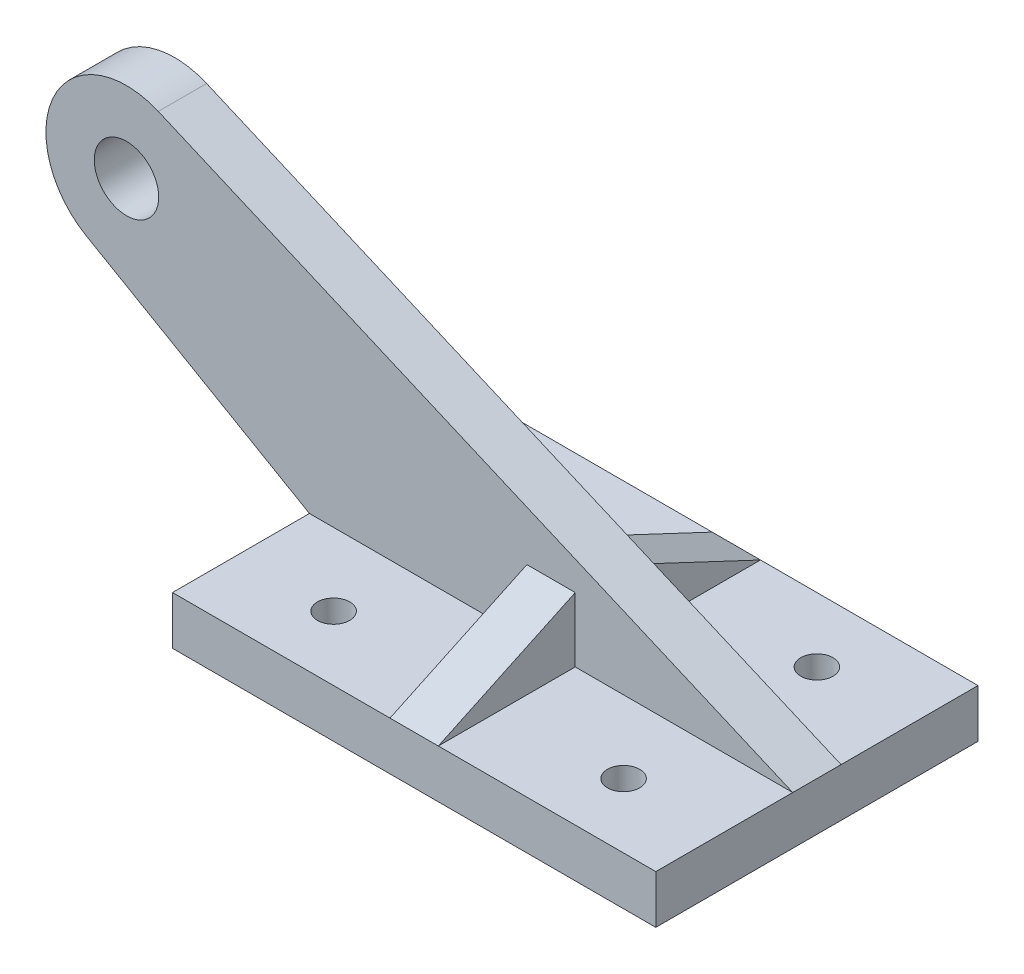
ISO-10303-21;
HEADER;
FILE_DESCRIPTION(('STEP AP214'),'2;1');
FILE_NAME('part.step','',(''),(''),'','','');
FILE_SCHEMA(('AUTOMOTIVE_DESIGN { 1 0 10303 214 1 1 1 1 }'));
ENDSEC;
DATA;
#1=APPLICATION_CONTEXT('core data for automotive mechanical design processes');
#2=APPLICATION_PROTOCOL_DEFINITION('international standard','automotive_design',2000,#1);
#3=PRODUCT_CONTEXT('',#1,'mechanical');
#4=PRODUCT('Part','Part','',(#3));
#5=PRODUCT_RELATED_PRODUCT_CATEGORY('part','',(#4));
#6=PRODUCT_DEFINITION_FORMATION('','',#4);
#7=PRODUCT_DEFINITION_CONTEXT('part definition',#1,'design');
#8=PRODUCT_DEFINITION('design','',#6,#7);
#9=PRODUCT_DEFINITION_SHAPE('','',#8);
#10=(LENGTH_UNIT() NAMED_UNIT(*) SI_UNIT(.MILLI.,.METRE.));
#11=(NAMED_UNIT(*) PLANE_ANGLE_UNIT() SI_UNIT($,.RADIAN.));
#12=(NAMED_UNIT(*) SI_UNIT($,.STERADIAN.) SOLID_ANGLE_UNIT());
#13=UNCERTAINTY_MEASURE_WITH_UNIT(LENGTH_MEASURE(1.E-05),#10,'distance_accuracy_value','');
#14=(GEOMETRIC_REPRESENTATION_CONTEXT(3) GLOBAL_UNCERTAINTY_ASSIGNED_CONTEXT((#13)) GLOBAL_UNIT_ASSIGNED_CONTEXT((#10,
#11,#12)) REPRESENTATION_CONTEXT('',''));
#15=CARTESIAN_POINT('',(0.,0.,0.));
#16=DIRECTION('',(0.,0.,1.));
#17=DIRECTION('',(1.,0.,0.));
#18=AXIS2_PLACEMENT_3D('',#15,#16,#17);
#19=CARTESIAN_POINT('',(0.,15.,0.));
#20=DIRECTION('',(0.,1.,0.));
#21=DIRECTION('',(0.,0.,1.));
#22=AXIS2_PLACEMENT_3D('',#19,#20,#21);
#23=PLANE('',#22);
#24=CARTESIAN_POINT('',(45.,15.,-30.));
#25=DIRECTION('',(0.,1.,0.));
#26=DIRECTION('',(0.,0.,1.));
#27=AXIS2_PLACEMENT_3D('',#24,#25,#26);
#28=CIRCLE('',#27,5.);
#29=CARTESIAN_POINT('',(45.,15.,-25.));
#30=VERTEX_POINT('',#29);
#31=EDGE_CURVE('E272',#30,#30,#28,.T.);
#32=ORIENTED_EDGE('',*,*,#31,.F.);
#33=EDGE_LOOP('',(#32));
#34=FACE_BOUND('',#33,.T.);
#35=DIRECTION('',(-1.,0.,0.));
#36=VECTOR('',#35,1.);
#37=CARTESIAN_POINT('',(-75.,15.,-50.));
#38=LINE('',#37,#36);
#39=CARTESIAN_POINT('',(75.,15.,-50.));
#40=VERTEX_POINT('',#39);
#41=CARTESIAN_POINT('',(7.5,15.,-50.));
#42=VERTEX_POINT('',#41);
#43=EDGE_CURVE('E158',#40,#42,#38,.T.);
#44=ORIENTED_EDGE('',*,*,#43,.T.);
#45=DIRECTION('',(0.,0.,-1.));
#46=VECTOR('',#45,1.);
#47=CARTESIAN_POINT('',(7.5,15.,-50.));
#48=LINE('',#47,#46);
#49=CARTESIAN_POINT('',(7.5,15.,-7.5));
#50=VERTEX_POINT('',#49);
#51=EDGE_CURVE('E145',#50,#42,#48,.T.);
#52=ORIENTED_EDGE('',*,*,#51,.F.);
#53=DIRECTION('',(1.,0.,0.));
#54=VECTOR('',#53,1.);
#55=CARTESIAN_POINT('',(75.,15.,-7.5));
#56=LINE('',#55,#54);
#57=CARTESIAN_POINT('',(75.,15.,-7.5));
#58=VERTEX_POINT('',#57);
#59=EDGE_CURVE('E543',#50,#58,#56,.T.);
#60=ORIENTED_EDGE('',*,*,#59,.T.);
#61=DIRECTION('',(0.,0.,-1.));
#62=VECTOR('',#61,1.);
#63=CARTESIAN_POINT('',(75.,15.,-50.));
#64=LINE('',#63,#62);
#65=EDGE_CURVE('E165',#58,#40,#64,.T.);
#66=ORIENTED_EDGE('',*,*,#65,.T.);
#67=EDGE_LOOP('',(#44,#52,#60,#66));
#68=FACE_BOUND('',#67,.T.);
#69=ADVANCED_FACE('F33',(#34,#68),#23,.T.);
#70=CARTESIAN_POINT('',(-131.782032302755,76.650635094611,-7.5));
#71=DIRECTION('',(0.,0.,1.));
#72=DIRECTION('',(1.,0.,0.));
#73=AXIS2_PLACEMENT_3D('',#70,#71,#72);
#74=PLANE('',#73);
#75=CARTESIAN_POINT('',(-131.782032302755,76.650635094611,-7.5));
#76=DIRECTION('',(0.,0.,1.));
#77=DIRECTION('',(1.,0.,0.));
#78=AXIS2_PLACEMENT_3D('',#75,#76,#77);
#79=CIRCLE('',#78,10.);
#80=CARTESIAN_POINT('',(-121.782032302755,76.650635094611,-7.5));
#81=VERTEX_POINT('',#80);
#82=EDGE_CURVE('E527',#81,#81,#79,.T.);
#83=ORIENTED_EDGE('',*,*,#82,.T.);
#84=EDGE_LOOP('',(#83));
#85=FACE_BOUND('',#84,.T.);
#86=DIRECTION('',(0.,-1.,0.));
#87=VECTOR('',#86,1.);
#88=CARTESIAN_POINT('',(7.5,15.,-7.5));
#89=LINE('',#88,#87);
#90=CARTESIAN_POINT('',(7.5,35.,-7.5));
#91=VERTEX_POINT('',#90);
#92=EDGE_CURVE('E144',#91,#50,#89,.T.);
#93=ORIENTED_EDGE('',*,*,#92,.F.);
#94=DIRECTION('',(-1.,0.,0.));
#95=VECTOR('',#94,1.);
#96=CARTESIAN_POINT('',(7.5,35.,-7.5));
#97=LINE('',#96,#95);
#98=CARTESIAN_POINT('',(-7.5,35.,-7.5));
#99=VERTEX_POINT('',#98);
#100=EDGE_CURVE('E141',#91,#99,#97,.T.);
#101=ORIENTED_EDGE('',*,*,#100,.T.);
#102=DIRECTION('',(0.,-1.,0.));
#103=VECTOR('',#102,1.);
#104=CARTESIAN_POINT('',(-7.5,15.,-7.5));
#105=LINE('',#104,#103);
#106=CARTESIAN_POINT('',(-7.50000000000001,15.,-7.5));
#107=VERTEX_POINT('',#106);
#108=EDGE_CURVE('E152',#99,#107,#105,.T.);
#109=ORIENTED_EDGE('',*,*,#108,.T.);
#110=CARTESIAN_POINT('',(-75.,15.,-7.5));
#111=VERTEX_POINT('',#110);
#112=EDGE_CURVE('E536',#111,#107,#56,.T.);
#113=ORIENTED_EDGE('',*,*,#112,.F.);
#114=DIRECTION('',(0.866025403784438,-0.500000000000001,0.));
#115=VECTOR('',#114,1.);
#116=CARTESIAN_POINT('',(-75.,15.,-7.5));
#117=LINE('',#116,#115);
#118=CARTESIAN_POINT('',(-144.282032302755,55.0000000000001,-7.5));
#119=VERTEX_POINT('',#118);
#120=EDGE_CURVE('E256',#119,#111,#117,.T.);
#121=ORIENTED_EDGE('',*,*,#120,.F.);
#122=CARTESIAN_POINT('',(-131.782032302755,76.650635094611,-7.5));
#123=DIRECTION('',(0.,0.,1.));
#124=DIRECTION('',(1.,0.,0.));
#125=AXIS2_PLACEMENT_3D('',#122,#123,#124);
#126=CIRCLE('',#125,25.);
#127=CARTESIAN_POINT('',(-121.911493446378,99.6195807100445,-7.5));
#128=VERTEX_POINT('',#127);
#129=EDGE_CURVE('E541',#128,#119,#126,.T.);
#130=ORIENTED_EDGE('',*,*,#129,.F.);
#131=DIRECTION('',(-0.91875782461734,0.394821554255101,0.));
#132=VECTOR('',#131,1.);
#133=CARTESIAN_POINT('',(75.,15.,-7.5));
#134=LINE('',#133,#132);
#135=EDGE_CURVE('E531',#58,#128,#134,.T.);
#136=ORIENTED_EDGE('',*,*,#135,.F.);
#137=ORIENTED_EDGE('',*,*,#59,.F.);
#138=EDGE_LOOP('',(#93,#101,#109,#113,#121,#130,#136,#137));
#139=FACE_BOUND('',#138,.T.);
#140=ADVANCED_FACE('F303',(#85,#139),#74,.F.);
#141=CARTESIAN_POINT('',(-45.,15.,30.));
#142=DIRECTION('',(0.,1.,0.));
#143=DIRECTION('',(0.,0.,1.));
#144=AXIS2_PLACEMENT_3D('',#141,#142,#143);
#145=CIRCLE('',#144,5.);
#146=CARTESIAN_POINT('',(-45.,15.,35.));
#147=VERTEX_POINT('',#146);
#148=EDGE_CURVE('E278',#147,#147,#145,.T.);
#149=ORIENTED_EDGE('',*,*,#148,.F.);
#150=EDGE_LOOP('',(#149));
#151=FACE_BOUND('',#150,.T.);
#152=DIRECTION('',(1.,0.,0.));
#153=VECTOR('',#152,1.);
#154=CARTESIAN_POINT('',(-75.,15.,50.));
#155=LINE('',#154,#153);
#156=CARTESIAN_POINT('',(-75.,15.,50.));
#157=VERTEX_POINT('',#156);
#158=CARTESIAN_POINT('',(-7.5,15.,50.));
#159=VERTEX_POINT('',#158);
#160=EDGE_CURVE('E176',#157,#159,#155,.T.);
#161=ORIENTED_EDGE('',*,*,#160,.T.);
#162=DIRECTION('',(0.,0.,-1.));
#163=VECTOR('',#162,1.);
#164=CARTESIAN_POINT('',(-7.5,15.,50.));
#165=LINE('',#164,#163);
#166=CARTESIAN_POINT('',(-7.5,15.,7.5));
#167=VERTEX_POINT('',#166);
#168=EDGE_CURVE('E162',#159,#167,#165,.T.);
#169=ORIENTED_EDGE('',*,*,#168,.T.);
#170=DIRECTION('',(1.,0.,0.));
#171=VECTOR('',#170,1.);
#172=CARTESIAN_POINT('',(75.,15.,7.5));
#173=LINE('',#172,#171);
#174=CARTESIAN_POINT('',(-75.,15.,7.5));
#175=VERTEX_POINT('',#174);
#176=EDGE_CURVE('E236',#175,#167,#173,.T.);
#177=ORIENTED_EDGE('',*,*,#176,.F.);
#178=DIRECTION('',(0.,0.,1.));
#179=VECTOR('',#178,1.);
#180=CARTESIAN_POINT('',(-75.,15.,-50.));
#181=LINE('',#180,#179);
#182=EDGE_CURVE('E166',#175,#157,#181,.T.);
#183=ORIENTED_EDGE('',*,*,#182,.T.);
#184=EDGE_LOOP('',(#161,#169,#177,#183));
#185=FACE_BOUND('',#184,.T.);
#186=ADVANCED_FACE('F233',(#151,#185),#23,.T.);
#187=DIRECTION('',(0.,0.,-1.));
#188=VECTOR('',#187,1.);
#189=CARTESIAN_POINT('',(-7.5,15.,-50.));
#190=LINE('',#189,#188);
#191=CARTESIAN_POINT('',(-7.5,15.,-50.));
#192=VERTEX_POINT('',#191);
#193=EDGE_CURVE('E48',#107,#192,#190,.T.);
#194=ORIENTED_EDGE('',*,*,#193,.T.);
#195=CARTESIAN_POINT('',(-75.,15.,-50.));
#196=VERTEX_POINT('',#195);
#197=EDGE_CURVE('E161',#192,#196,#38,.T.);
#198=ORIENTED_EDGE('',*,*,#197,.T.);
#199=EDGE_CURVE('E168',#196,#111,#181,.T.);
#200=ORIENTED_EDGE('',*,*,#199,.T.);
#201=ORIENTED_EDGE('',*,*,#112,.T.);
#202=EDGE_LOOP('',(#194,#198,#200,#201));
#203=FACE_BOUND('',#202,.T.);
#204=CARTESIAN_POINT('',(-45.,15.,-30.));
#205=DIRECTION('',(0.,1.,0.));
#206=DIRECTION('',(0.,0.,1.));
#207=AXIS2_PLACEMENT_3D('',#204,#205,#206);
#208=CIRCLE('',#207,5.);
#209=CARTESIAN_POINT('',(-45.,15.,-25.));
#210=VERTEX_POINT('',#209);
#211=EDGE_CURVE('E267',#210,#210,#208,.T.);
#212=ORIENTED_EDGE('',*,*,#211,.F.);
#213=EDGE_LOOP('',(#212));
#214=FACE_BOUND('',#213,.T.);
#215=ADVANCED_FACE('F293',(#203,#214),#23,.T.);
#216=CARTESIAN_POINT('',(75.,15.,-50.));
#217=DIRECTION('',(-1.,0.,0.));
#218=DIRECTION('',(0.,0.,1.));
#219=AXIS2_PLACEMENT_3D('',#216,#217,#218);
#220=PLANE('',#219);
#221=DIRECTION('',(0.,0.,-1.));
#222=VECTOR('',#221,1.);
#223=CARTESIAN_POINT('',(75.,0.,-50.));
#224=LINE('',#223,#222);
#225=CARTESIAN_POINT('',(75.,0.,50.));
#226=VERTEX_POINT('',#225);
#227=CARTESIAN_POINT('',(75.,0.,-50.));
#228=VERTEX_POINT('',#227);
#229=EDGE_CURVE('E180',#226,#228,#224,.T.);
#230=ORIENTED_EDGE('',*,*,#229,.T.);
#231=DIRECTION('',(0.,-1.,0.));
#232=VECTOR('',#231,1.);
#233=CARTESIAN_POINT('',(75.,15.,-50.));
#234=LINE('',#233,#232);
#235=EDGE_CURVE('E11',#40,#228,#234,.T.);
#236=ORIENTED_EDGE('',*,*,#235,.F.);
#237=ORIENTED_EDGE('',*,*,#65,.F.);
#238=DIRECTION('',(0.,0.,-1.));
#239=VECTOR('',#238,1.);
#240=CARTESIAN_POINT('',(75.,15.,7.5));
#241=LINE('',#240,#239);
#242=CARTESIAN_POINT('',(75.,15.,7.5));
#243=VERTEX_POINT('',#242);
#244=EDGE_CURVE('E214',#243,#58,#241,.T.);
#245=ORIENTED_EDGE('',*,*,#244,.F.);
#246=CARTESIAN_POINT('',(75.,15.,50.));
#247=VERTEX_POINT('',#246);
#248=EDGE_CURVE('E170',#247,#243,#64,.T.);
#249=ORIENTED_EDGE('',*,*,#248,.F.);
#250=DIRECTION('',(0.,-1.,0.));
#251=VECTOR('',#250,1.);
#252=CARTESIAN_POINT('',(75.,15.,50.));
#253=LINE('',#252,#251);
#254=EDGE_CURVE('E179',#247,#226,#253,.T.);
#255=ORIENTED_EDGE('',*,*,#254,.T.);
#256=EDGE_LOOP('',(#230,#236,#237,#245,#249,#255));
#257=FACE_BOUND('',#256,.T.);
#258=ADVANCED_FACE('F35',(#257),#220,.F.);
#259=CARTESIAN_POINT('',(-75.,15.,-50.));
#260=DIRECTION('',(0.,0.,1.));
#261=DIRECTION('',(1.,0.,0.));
#262=AXIS2_PLACEMENT_3D('',#259,#260,#261);
#263=PLANE('',#262);
#264=DIRECTION('',(-1.,0.,0.));
#265=VECTOR('',#264,1.);
#266=CARTESIAN_POINT('',(-75.,0.,-50.));
#267=LINE('',#266,#265);
#268=CARTESIAN_POINT('',(-75.,0.,-50.));
#269=VERTEX_POINT('',#268);
#270=EDGE_CURVE('E183',#228,#269,#267,.T.);
#271=ORIENTED_EDGE('',*,*,#270,.T.);
#272=DIRECTION('',(0.,-1.,0.));
#273=VECTOR('',#272,1.);
#274=CARTESIAN_POINT('',(-75.,15.,-50.));
#275=LINE('',#274,#273);
#276=EDGE_CURVE('E41',#196,#269,#275,.T.);
#277=ORIENTED_EDGE('',*,*,#276,.F.);
#278=ORIENTED_EDGE('',*,*,#197,.F.);
#279=DIRECTION('',(-1.,0.,0.));
#280=VECTOR('',#279,1.);
#281=CARTESIAN_POINT('',(7.5,15.,-50.));
#282=LINE('',#281,#280);
#283=EDGE_CURVE('E139',#42,#192,#282,.T.);
#284=ORIENTED_EDGE('',*,*,#283,.F.);
#285=ORIENTED_EDGE('',*,*,#43,.F.);
#286=ORIENTED_EDGE('',*,*,#235,.T.);
#287=EDGE_LOOP('',(#271,#277,#278,#284,#285,#286));
#288=FACE_BOUND('',#287,.T.);
#289=ADVANCED_FACE('F157',(#288),#263,.F.);
#290=CARTESIAN_POINT('',(-75.,15.,-50.));
#291=DIRECTION('',(1.,0.,0.));
#292=DIRECTION('',(0.,0.,-1.));
#293=AXIS2_PLACEMENT_3D('',#290,#291,#292);
#294=PLANE('',#293);
#295=DIRECTION('',(0.,0.,1.));
#296=VECTOR('',#295,1.);
#297=CARTESIAN_POINT('',(-75.,0.,-50.));
#298=LINE('',#297,#296);
#299=CARTESIAN_POINT('',(-75.,0.,50.));
#300=VERTEX_POINT('',#299);
#301=EDGE_CURVE('E186',#269,#300,#298,.T.);
#302=ORIENTED_EDGE('',*,*,#301,.T.);
#303=DIRECTION('',(0.,-1.,0.));
#304=VECTOR('',#303,1.);
#305=CARTESIAN_POINT('',(-75.,15.,50.));
#306=LINE('',#305,#304);
#307=EDGE_CURVE('E192',#157,#300,#306,.T.);
#308=ORIENTED_EDGE('',*,*,#307,.F.);
#309=ORIENTED_EDGE('',*,*,#182,.F.);
#310=DIRECTION('',(0.,0.,-1.));
#311=VECTOR('',#310,1.);
#312=CARTESIAN_POINT('',(-75.,15.,7.5));
#313=LINE('',#312,#311);
#314=EDGE_CURVE('E239',#175,#111,#313,.T.);
#315=ORIENTED_EDGE('',*,*,#314,.T.);
#316=ORIENTED_EDGE('',*,*,#199,.F.);
#317=ORIENTED_EDGE('',*,*,#276,.T.);
#318=EDGE_LOOP('',(#302,#308,#309,#315,#316,#317));
#319=FACE_BOUND('',#318,.T.);
#320=ADVANCED_FACE('F198',(#319),#294,.F.);
#321=CARTESIAN_POINT('',(-75.,15.,50.));
#322=DIRECTION('',(0.,0.,-1.));
#323=DIRECTION('',(-1.,0.,0.));
#324=AXIS2_PLACEMENT_3D('',#321,#322,#323);
#325=PLANE('',#324);
#326=DIRECTION('',(1.,0.,0.));
#327=VECTOR('',#326,1.);
#328=CARTESIAN_POINT('',(-75.,0.,50.));
#329=LINE('',#328,#327);
#330=EDGE_CURVE('E188',#300,#226,#329,.T.);
#331=ORIENTED_EDGE('',*,*,#330,.T.);
#332=ORIENTED_EDGE('',*,*,#254,.F.);
#333=CARTESIAN_POINT('',(7.5,15.,50.));
#334=VERTEX_POINT('',#333);
#335=EDGE_CURVE('E175',#334,#247,#155,.T.);
#336=ORIENTED_EDGE('',*,*,#335,.F.);
#337=DIRECTION('',(-1.,0.,0.));
#338=VECTOR('',#337,1.);
#339=CARTESIAN_POINT('',(7.5,15.,50.));
#340=LINE('',#339,#338);
#341=EDGE_CURVE('E225',#334,#159,#340,.T.);
#342=ORIENTED_EDGE('',*,*,#341,.T.);
#343=ORIENTED_EDGE('',*,*,#160,.F.);
#344=ORIENTED_EDGE('',*,*,#307,.T.);
#345=EDGE_LOOP('',(#331,#332,#336,#342,#343,#344));
#346=FACE_BOUND('',#345,.T.);
#347=ADVANCED_FACE('F206',(#346),#325,.F.);
#348=DIRECTION('',(0.,0.,-1.));
#349=VECTOR('',#348,1.);
#350=CARTESIAN_POINT('',(7.5,15.,50.));
#351=LINE('',#350,#349);
#352=CARTESIAN_POINT('',(7.5,15.,7.5));
#353=VERTEX_POINT('',#352);
#354=EDGE_CURVE('E222',#334,#353,#351,.T.);
#355=ORIENTED_EDGE('',*,*,#354,.F.);
#356=ORIENTED_EDGE('',*,*,#335,.T.);
#357=ORIENTED_EDGE('',*,*,#248,.T.);
#358=EDGE_CURVE('E221',#353,#243,#173,.T.);
#359=ORIENTED_EDGE('',*,*,#358,.F.);
#360=EDGE_LOOP('',(#355,#356,#357,#359));
#361=FACE_BOUND('',#360,.T.);
#362=CARTESIAN_POINT('',(45.,15.,30.));
#363=DIRECTION('',(0.,1.,0.));
#364=DIRECTION('',(0.,0.,1.));
#365=AXIS2_PLACEMENT_3D('',#362,#363,#364);
#366=CIRCLE('',#365,5.);
#367=CARTESIAN_POINT('',(45.,15.,35.));
#368=VERTEX_POINT('',#367);
#369=EDGE_CURVE('E271',#368,#368,#366,.T.);
#370=ORIENTED_EDGE('',*,*,#369,.F.);
#371=EDGE_LOOP('',(#370));
#372=FACE_BOUND('',#371,.T.);
#373=ADVANCED_FACE('F219',(#361,#372),#23,.T.);
#374=CARTESIAN_POINT('',(0.,0.,0.));
#375=DIRECTION('',(0.,1.,0.));
#376=DIRECTION('',(0.,0.,1.));
#377=AXIS2_PLACEMENT_3D('',#374,#375,#376);
#378=PLANE('',#377);
#379=CARTESIAN_POINT('',(45.,0.,-30.));
#380=DIRECTION('',(0.,1.,0.));
#381=DIRECTION('',(0.,0.,1.));
#382=AXIS2_PLACEMENT_3D('',#379,#380,#381);
#383=CIRCLE('',#382,5.);
#384=CARTESIAN_POINT('',(45.,0.,-25.));
#385=VERTEX_POINT('',#384);
#386=EDGE_CURVE('E268',#385,#385,#383,.T.);
#387=ORIENTED_EDGE('',*,*,#386,.T.);
#388=EDGE_LOOP('',(#387));
#389=FACE_BOUND('',#388,.T.);
#390=CARTESIAN_POINT('',(-45.,0.,30.));
#391=DIRECTION('',(0.,1.,0.));
#392=DIRECTION('',(0.,0.,1.));
#393=AXIS2_PLACEMENT_3D('',#390,#391,#392);
#394=CIRCLE('',#393,5.);
#395=CARTESIAN_POINT('',(-45.,0.,35.));
#396=VERTEX_POINT('',#395);
#397=EDGE_CURVE('E275',#396,#396,#394,.T.);
#398=ORIENTED_EDGE('',*,*,#397,.T.);
#399=EDGE_LOOP('',(#398));
#400=FACE_BOUND('',#399,.T.);
#401=CARTESIAN_POINT('',(-45.,0.,-30.));
#402=DIRECTION('',(0.,1.,0.));
#403=DIRECTION('',(0.,0.,1.));
#404=AXIS2_PLACEMENT_3D('',#401,#402,#403);
#405=CIRCLE('',#404,5.);
#406=CARTESIAN_POINT('',(-45.,0.,-25.));
#407=VERTEX_POINT('',#406);
#408=EDGE_CURVE('E281',#407,#407,#405,.T.);
#409=ORIENTED_EDGE('',*,*,#408,.T.);
#410=EDGE_LOOP('',(#409));
#411=FACE_BOUND('',#410,.T.);
#412=CARTESIAN_POINT('',(45.,0.,30.));
#413=DIRECTION('',(0.,1.,0.));
#414=DIRECTION('',(0.,0.,1.));
#415=AXIS2_PLACEMENT_3D('',#412,#413,#414);
#416=CIRCLE('',#415,5.);
#417=CARTESIAN_POINT('',(45.,0.,35.));
#418=VERTEX_POINT('',#417);
#419=EDGE_CURVE('E184',#418,#418,#416,.T.);
#420=ORIENTED_EDGE('',*,*,#419,.T.);
#421=EDGE_LOOP('',(#420));
#422=FACE_BOUND('',#421,.T.);
#423=ORIENTED_EDGE('',*,*,#229,.F.);
#424=ORIENTED_EDGE('',*,*,#330,.F.);
#425=ORIENTED_EDGE('',*,*,#301,.F.);
#426=ORIENTED_EDGE('',*,*,#270,.F.);
#427=EDGE_LOOP('',(#423,#424,#425,#426));
#428=FACE_BOUND('',#427,.T.);
#429=ADVANCED_FACE('F203',(#389,#400,#411,#422,#428),#378,.F.);
#430=CARTESIAN_POINT('',(45.,0.,30.));
#431=DIRECTION('',(0.,1.,0.));
#432=DIRECTION('',(0.,0.,1.));
#433=AXIS2_PLACEMENT_3D('',#430,#431,#432);
#434=CYLINDRICAL_SURFACE('',#433,5.);
#435=ORIENTED_EDGE('',*,*,#419,.F.);
#436=EDGE_LOOP('',(#435));
#437=FACE_BOUND('',#436,.T.);
#438=ORIENTED_EDGE('',*,*,#369,.T.);
#439=EDGE_LOOP('',(#438));
#440=FACE_BOUND('',#439,.T.);
#441=ADVANCED_FACE('F290',(#437,#440),#434,.F.);
#442=CARTESIAN_POINT('',(-45.,0.,-30.));
#443=DIRECTION('',(0.,1.,0.));
#444=DIRECTION('',(0.,0.,1.));
#445=AXIS2_PLACEMENT_3D('',#442,#443,#444);
#446=CYLINDRICAL_SURFACE('',#445,5.);
#447=ORIENTED_EDGE('',*,*,#408,.F.);
#448=EDGE_LOOP('',(#447));
#449=FACE_BOUND('',#448,.T.);
#450=ORIENTED_EDGE('',*,*,#211,.T.);
#451=EDGE_LOOP('',(#450));
#452=FACE_BOUND('',#451,.T.);
#453=ADVANCED_FACE('F316',(#449,#452),#446,.F.);
#454=CARTESIAN_POINT('',(-45.,0.,30.));
#455=DIRECTION('',(0.,1.,0.));
#456=DIRECTION('',(0.,0.,1.));
#457=AXIS2_PLACEMENT_3D('',#454,#455,#456);
#458=CYLINDRICAL_SURFACE('',#457,5.);
#459=ORIENTED_EDGE('',*,*,#397,.F.);
#460=EDGE_LOOP('',(#459));
#461=FACE_BOUND('',#460,.T.);
#462=ORIENTED_EDGE('',*,*,#148,.T.);
#463=EDGE_LOOP('',(#462));
#464=FACE_BOUND('',#463,.T.);
#465=ADVANCED_FACE('F318',(#461,#464),#458,.F.);
#466=CARTESIAN_POINT('',(45.,0.,-30.));
#467=DIRECTION('',(0.,1.,0.));
#468=DIRECTION('',(0.,0.,1.));
#469=AXIS2_PLACEMENT_3D('',#466,#467,#468);
#470=CYLINDRICAL_SURFACE('',#469,5.);
#471=ORIENTED_EDGE('',*,*,#386,.F.);
#472=EDGE_LOOP('',(#471));
#473=FACE_BOUND('',#472,.T.);
#474=ORIENTED_EDGE('',*,*,#31,.T.);
#475=EDGE_LOOP('',(#474));
#476=FACE_BOUND('',#475,.T.);
#477=ADVANCED_FACE('F325',(#473,#476),#470,.F.);
#478=CARTESIAN_POINT('',(-131.782032302755,76.650635094611,7.5));
#479=DIRECTION('',(0.,0.,1.));
#480=DIRECTION('',(1.,0.,0.));
#481=AXIS2_PLACEMENT_3D('',#478,#479,#480);
#482=PLANE('',#481);
#483=DIRECTION('',(0.,1.,0.));
#484=VECTOR('',#483,1.);
#485=CARTESIAN_POINT('',(7.5,15.,7.5));
#486=LINE('',#485,#484);
#487=CARTESIAN_POINT('',(7.5,35.,7.5));
#488=VERTEX_POINT('',#487);
#489=EDGE_CURVE('E516',#353,#488,#486,.T.);
#490=ORIENTED_EDGE('',*,*,#489,.F.);
#491=ORIENTED_EDGE('',*,*,#358,.T.);
#492=DIRECTION('',(-0.91875782461734,0.394821554255101,0.));
#493=VECTOR('',#492,1.);
#494=CARTESIAN_POINT('',(75.,15.,7.5));
#495=LINE('',#494,#493);
#496=CARTESIAN_POINT('',(-121.911493446378,99.6195807100445,7.5));
#497=VERTEX_POINT('',#496);
#498=EDGE_CURVE('E534',#243,#497,#495,.T.);
#499=ORIENTED_EDGE('',*,*,#498,.T.);
#500=CARTESIAN_POINT('',(-131.782032302755,76.650635094611,7.5));
#501=DIRECTION('',(0.,0.,1.));
#502=DIRECTION('',(1.,0.,0.));
#503=AXIS2_PLACEMENT_3D('',#500,#501,#502);
#504=CIRCLE('',#503,25.);
#505=CARTESIAN_POINT('',(-144.282032302755,55.0000000000001,7.5));
#506=VERTEX_POINT('',#505);
#507=EDGE_CURVE('E248',#497,#506,#504,.T.);
#508=ORIENTED_EDGE('',*,*,#507,.T.);
#509=DIRECTION('',(0.866025403784438,-0.500000000000001,0.));
#510=VECTOR('',#509,1.);
#511=CARTESIAN_POINT('',(-75.,15.,7.5));
#512=LINE('',#511,#510);
#513=EDGE_CURVE('E242',#506,#175,#512,.T.);
#514=ORIENTED_EDGE('',*,*,#513,.T.);
#515=ORIENTED_EDGE('',*,*,#176,.T.);
#516=DIRECTION('',(0.,1.,0.));
#517=VECTOR('',#516,1.);
#518=CARTESIAN_POINT('',(-7.5,15.,7.5));
#519=LINE('',#518,#517);
#520=CARTESIAN_POINT('',(-7.50000000000001,35.,7.5));
#521=VERTEX_POINT('',#520);
#522=EDGE_CURVE('E523',#167,#521,#519,.T.);
#523=ORIENTED_EDGE('',*,*,#522,.T.);
#524=DIRECTION('',(-1.,0.,0.));
#525=VECTOR('',#524,1.);
#526=CARTESIAN_POINT('',(7.5,35.,7.5));
#527=LINE('',#526,#525);
#528=EDGE_CURVE('E228',#488,#521,#527,.T.);
#529=ORIENTED_EDGE('',*,*,#528,.F.);
#530=EDGE_LOOP('',(#490,#491,#499,#508,#514,#515,#523,#529));
#531=FACE_BOUND('',#530,.T.);
#532=CARTESIAN_POINT('',(-131.782032302755,76.650635094611,7.5));
#533=DIRECTION('',(0.,0.,1.));
#534=DIRECTION('',(1.,0.,0.));
#535=AXIS2_PLACEMENT_3D('',#532,#533,#534);
#536=CIRCLE('',#535,10.);
#537=CARTESIAN_POINT('',(-121.782032302755,76.650635094611,7.5));
#538=VERTEX_POINT('',#537);
#539=EDGE_CURVE('E528',#538,#538,#536,.T.);
#540=ORIENTED_EDGE('',*,*,#539,.F.);
#541=EDGE_LOOP('',(#540));
#542=FACE_BOUND('',#541,.T.);
#543=ADVANCED_FACE('F244',(#531,#542),#482,.T.);
#544=CARTESIAN_POINT('',(75.,15.,7.5));
#545=DIRECTION('',(-0.394821554255101,-0.91875782461734,0.));
#546=DIRECTION('',(0.91875782461734,-0.394821554255101,0.));
#547=AXIS2_PLACEMENT_3D('',#544,#545,#546);
#548=PLANE('',#547);
#549=ORIENTED_EDGE('',*,*,#135,.T.);
#550=DIRECTION('',(0.,0.,-1.));
#551=VECTOR('',#550,1.);
#552=CARTESIAN_POINT('',(-121.911493446378,99.6195807100445,7.5));
#553=LINE('',#552,#551);
#554=EDGE_CURVE('E260',#497,#128,#553,.T.);
#555=ORIENTED_EDGE('',*,*,#554,.F.);
#556=ORIENTED_EDGE('',*,*,#498,.F.);
#557=ORIENTED_EDGE('',*,*,#244,.T.);
#558=EDGE_LOOP('',(#549,#555,#556,#557));
#559=FACE_BOUND('',#558,.T.);
#560=ADVANCED_FACE('F334',(#559),#548,.F.);
#561=CARTESIAN_POINT('',(-131.782032302755,76.650635094611,7.5));
#562=DIRECTION('',(0.,0.,-1.));
#563=DIRECTION('',(-1.,0.,0.));
#564=AXIS2_PLACEMENT_3D('',#561,#562,#563);
#565=CYLINDRICAL_SURFACE('',#564,25.);
#566=ORIENTED_EDGE('',*,*,#129,.T.);
#567=DIRECTION('',(0.,0.,-1.));
#568=VECTOR('',#567,1.);
#569=CARTESIAN_POINT('',(-144.282032302755,55.0000000000001,7.5));
#570=LINE('',#569,#568);
#571=EDGE_CURVE('E258',#506,#119,#570,.T.);
#572=ORIENTED_EDGE('',*,*,#571,.F.);
#573=ORIENTED_EDGE('',*,*,#507,.F.);
#574=ORIENTED_EDGE('',*,*,#554,.T.);
#575=EDGE_LOOP('',(#566,#572,#573,#574));
#576=FACE_BOUND('',#575,.T.);
#577=ADVANCED_FACE('F337',(#576),#565,.T.);
#578=CARTESIAN_POINT('',(-75.,15.,7.5));
#579=DIRECTION('',(0.500000000000001,0.866025403784438,0.));
#580=DIRECTION('',(-0.866025403784438,0.500000000000001,0.));
#581=AXIS2_PLACEMENT_3D('',#578,#579,#580);
#582=PLANE('',#581);
#583=ORIENTED_EDGE('',*,*,#120,.T.);
#584=ORIENTED_EDGE('',*,*,#314,.F.);
#585=ORIENTED_EDGE('',*,*,#513,.F.);
#586=ORIENTED_EDGE('',*,*,#571,.T.);
#587=EDGE_LOOP('',(#583,#584,#585,#586));
#588=FACE_BOUND('',#587,.T.);
#589=ADVANCED_FACE('F254',(#588),#582,.F.);
#590=CARTESIAN_POINT('',(-131.782032302755,76.650635094611,7.5));
#591=DIRECTION('',(0.,0.,-1.));
#592=DIRECTION('',(-1.,0.,0.));
#593=AXIS2_PLACEMENT_3D('',#590,#591,#592);
#594=CYLINDRICAL_SURFACE('',#593,10.);
#595=ORIENTED_EDGE('',*,*,#539,.T.);
#596=EDGE_LOOP('',(#595));
#597=FACE_BOUND('',#596,.T.);
#598=ORIENTED_EDGE('',*,*,#82,.F.);
#599=EDGE_LOOP('',(#598));
#600=FACE_BOUND('',#599,.T.);
#601=ADVANCED_FACE('F344',(#597,#600),#594,.F.);
#602=CARTESIAN_POINT('',(7.5,35.,7.5));
#603=DIRECTION('',(0.,-0.904818702200994,-0.42579703632988));
#604=DIRECTION('',(0.,0.42579703632988,-0.904818702200994));
#605=AXIS2_PLACEMENT_3D('',#602,#603,#604);
#606=PLANE('',#605);
#607=DIRECTION('',(0.,-0.42579703632988,0.904818702200994));
#608=VECTOR('',#607,1.);
#609=CARTESIAN_POINT('',(-7.5,35.,7.5));
#610=LINE('',#609,#608);
#611=EDGE_CURVE('E56',#521,#159,#610,.T.);
#612=ORIENTED_EDGE('',*,*,#611,.T.);
#613=ORIENTED_EDGE('',*,*,#341,.F.);
#614=DIRECTION('',(0.,-0.42579703632988,0.904818702200994));
#615=VECTOR('',#614,1.);
#616=CARTESIAN_POINT('',(7.5,35.,7.5));
#617=LINE('',#616,#615);
#618=EDGE_CURVE('E229',#488,#334,#617,.T.);
#619=ORIENTED_EDGE('',*,*,#618,.F.);
#620=ORIENTED_EDGE('',*,*,#528,.T.);
#621=EDGE_LOOP('',(#612,#613,#619,#620));
#622=FACE_BOUND('',#621,.T.);
#623=ADVANCED_FACE('F352',(#622),#606,.F.);
#624=CARTESIAN_POINT('',(7.5,0.,0.));
#625=DIRECTION('',(1.,0.,0.));
#626=DIRECTION('',(0.,0.,-1.));
#627=AXIS2_PLACEMENT_3D('',#624,#625,#626);
#628=PLANE('',#627);
#629=ORIENTED_EDGE('',*,*,#354,.T.);
#630=ORIENTED_EDGE('',*,*,#489,.T.);
#631=ORIENTED_EDGE('',*,*,#618,.T.);
#632=EDGE_LOOP('',(#629,#630,#631));
#633=FACE_BOUND('',#632,.T.);
#634=ADVANCED_FACE('F356',(#633),#628,.T.);
#635=CARTESIAN_POINT('',(-7.5,0.,0.));
#636=DIRECTION('',(1.,0.,0.));
#637=DIRECTION('',(0.,0.,-1.));
#638=AXIS2_PLACEMENT_3D('',#635,#636,#637);
#639=PLANE('',#638);
#640=ORIENTED_EDGE('',*,*,#168,.F.);
#641=ORIENTED_EDGE('',*,*,#611,.F.);
#642=ORIENTED_EDGE('',*,*,#522,.F.);
#643=EDGE_LOOP('',(#640,#641,#642));
#644=FACE_BOUND('',#643,.T.);
#645=ADVANCED_FACE('F357',(#644),#639,.F.);
#646=CARTESIAN_POINT('',(7.5,35.,-7.5));
#647=DIRECTION('',(0.,-0.904818702200994,0.42579703632988));
#648=DIRECTION('',(0.,-0.42579703632988,-0.904818702200994));
#649=AXIS2_PLACEMENT_3D('',#646,#647,#648);
#650=PLANE('',#649);
#651=DIRECTION('',(0.,0.42579703632988,0.904818702200994));
#652=VECTOR('',#651,1.);
#653=CARTESIAN_POINT('',(-7.5,35.,-7.5));
#654=LINE('',#653,#652);
#655=EDGE_CURVE('E547',#192,#99,#654,.T.);
#656=ORIENTED_EDGE('',*,*,#655,.T.);
#657=ORIENTED_EDGE('',*,*,#100,.F.);
#658=DIRECTION('',(0.,0.42579703632988,0.904818702200994));
#659=VECTOR('',#658,1.);
#660=CARTESIAN_POINT('',(7.5,35.,-7.5));
#661=LINE('',#660,#659);
#662=EDGE_CURVE('E135',#42,#91,#661,.T.);
#663=ORIENTED_EDGE('',*,*,#662,.F.);
#664=ORIENTED_EDGE('',*,*,#283,.T.);
#665=EDGE_LOOP('',(#656,#657,#663,#664));
#666=FACE_BOUND('',#665,.T.);
#667=ADVANCED_FACE('F137',(#666),#650,.F.);
#668=CARTESIAN_POINT('',(7.5,0.,0.));
#669=DIRECTION('',(-1.,0.,0.));
#670=DIRECTION('',(0.,0.,1.));
#671=AXIS2_PLACEMENT_3D('',#668,#669,#670);
#672=PLANE('',#671);
#673=ORIENTED_EDGE('',*,*,#51,.T.);
#674=ORIENTED_EDGE('',*,*,#662,.T.);
#675=ORIENTED_EDGE('',*,*,#92,.T.);
#676=EDGE_LOOP('',(#673,#674,#675));
#677=FACE_BOUND('',#676,.T.);
#678=ADVANCED_FACE('F148',(#677),#672,.F.);
#679=CARTESIAN_POINT('',(-7.5,0.,0.));
#680=DIRECTION('',(-1.,0.,0.));
#681=DIRECTION('',(0.,0.,1.));
#682=AXIS2_PLACEMENT_3D('',#679,#680,#681);
#683=PLANE('',#682);
#684=ORIENTED_EDGE('',*,*,#193,.F.);
#685=ORIENTED_EDGE('',*,*,#108,.F.);
#686=ORIENTED_EDGE('',*,*,#655,.F.);
#687=EDGE_LOOP('',(#684,#685,#686));
#688=FACE_BOUND('',#687,.T.);
#689=ADVANCED_FACE('F365',(#688),#683,.T.);
#690=CLOSED_SHELL('',(#69,#140,#186,#215,#258,#289,#320,#347,#373,#429,#441,#453,#465,#477,#543,
#560,#577,#589,#601,#623,#634,#645,#667,#678,#689));
#691=MANIFOLD_SOLID_BREP('B2',#690);
#692=ADVANCED_BREP_SHAPE_REPRESENTATION('',(#18,#691),#14);
#693=SHAPE_DEFINITION_REPRESENTATION(#9,#692);
ENDSEC;
END-ISO-10303-21;
